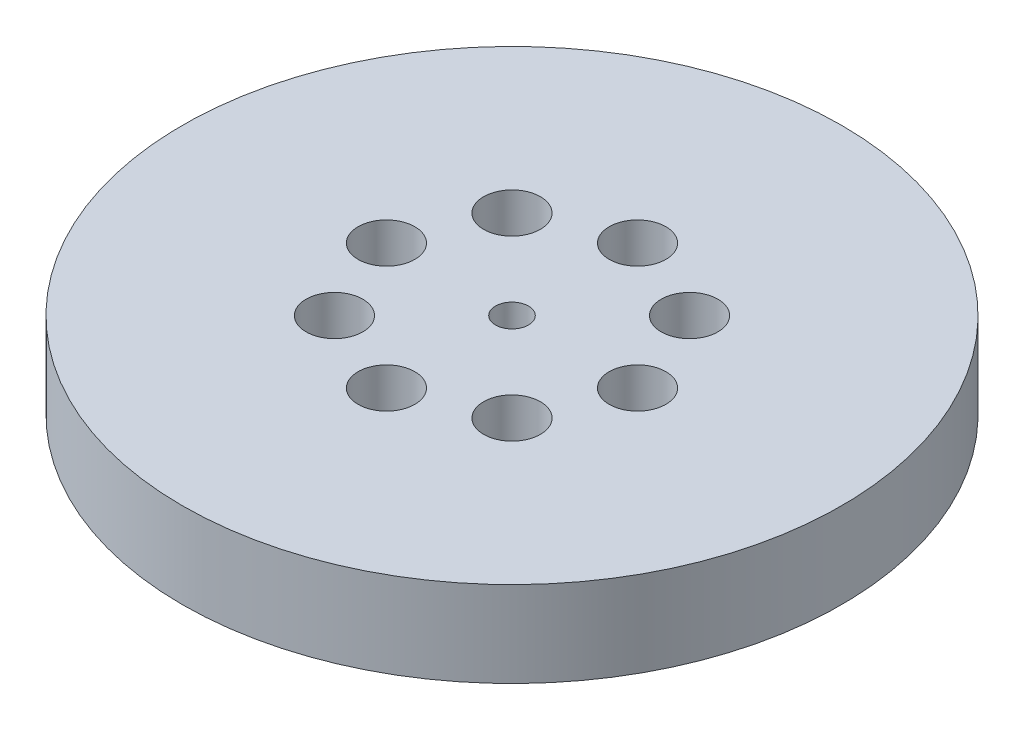
ISO-10303-21;
HEADER;
FILE_DESCRIPTION(('STEP AP214'),'2;1');
FILE_NAME('part.step','',(''),(''),'','','');
FILE_SCHEMA(('AUTOMOTIVE_DESIGN { 1 0 10303 214 1 1 1 1 }'));
ENDSEC;
DATA;
#1=APPLICATION_CONTEXT('core data for automotive mechanical design processes');
#2=APPLICATION_PROTOCOL_DEFINITION('international standard','automotive_design',2000,#1);
#3=PRODUCT_CONTEXT('',#1,'mechanical');
#4=PRODUCT('Part','Part','',(#3));
#5=PRODUCT_RELATED_PRODUCT_CATEGORY('part','',(#4));
#6=PRODUCT_DEFINITION_FORMATION('','',#4);
#7=PRODUCT_DEFINITION_CONTEXT('part definition',#1,'design');
#8=PRODUCT_DEFINITION('design','',#6,#7);
#9=PRODUCT_DEFINITION_SHAPE('','',#8);
#10=(LENGTH_UNIT() NAMED_UNIT(*) SI_UNIT(.MILLI.,.METRE.));
#11=(NAMED_UNIT(*) PLANE_ANGLE_UNIT() SI_UNIT($,.RADIAN.));
#12=(NAMED_UNIT(*) SI_UNIT($,.STERADIAN.) SOLID_ANGLE_UNIT());
#13=UNCERTAINTY_MEASURE_WITH_UNIT(LENGTH_MEASURE(1.E-05),#10,'distance_accuracy_value','');
#14=(GEOMETRIC_REPRESENTATION_CONTEXT(3) GLOBAL_UNCERTAINTY_ASSIGNED_CONTEXT((#13)) GLOBAL_UNIT_ASSIGNED_CONTEXT((#10,
#11,#12)) REPRESENTATION_CONTEXT('',''));
#15=CARTESIAN_POINT('',(0.,0.,0.));
#16=DIRECTION('',(0.,0.,1.));
#17=DIRECTION('',(1.,0.,0.));
#18=AXIS2_PLACEMENT_3D('',#15,#16,#17);
#19=CARTESIAN_POINT('',(0.,26.,0.));
#20=DIRECTION('',(0.,-1.,0.));
#21=DIRECTION('',(0.,0.,-1.));
#22=AXIS2_PLACEMENT_3D('',#19,#20,#21);
#23=CYLINDRICAL_SURFACE('',#22,100.);
#24=CARTESIAN_POINT('',(0.,26.,0.));
#25=DIRECTION('',(0.,1.,0.));
#26=DIRECTION('',(0.,0.,1.));
#27=AXIS2_PLACEMENT_3D('',#24,#25,#26);
#28=CIRCLE('',#27,100.);
#29=CARTESIAN_POINT('',(0.,26.,-100.));
#30=VERTEX_POINT('',#29);
#31=EDGE_CURVE('E10',#30,#30,#28,.T.);
#32=CARTESIAN_POINT('',(0.,0.,0.));
#33=DIRECTION('',(0.,1.,0.));
#34=DIRECTION('',(0.,0.,1.));
#35=AXIS2_PLACEMENT_3D('',#32,#33,#34);
#36=CIRCLE('',#35,100.);
#37=CARTESIAN_POINT('',(0.,0.,-100.));
#38=VERTEX_POINT('',#37);
#39=EDGE_CURVE('E37',#38,#38,#36,.T.);
#40=CARTESIAN_POINT('',(0.,26.,-100.));
#41=CARTESIAN_POINT('',(0.,25.7291666666667,-100.));
#42=CARTESIAN_POINT('',(0.,25.4583333333333,-100.));
#43=CARTESIAN_POINT('',(0.,24.9166666666667,-100.));
#44=CARTESIAN_POINT('',(0.,24.6458333333333,-100.));
#45=CARTESIAN_POINT('',(0.,24.1041666666667,-100.));
#46=CARTESIAN_POINT('',(0.,23.8333333333333,-100.));
#47=CARTESIAN_POINT('',(0.,23.2916666666667,-100.));
#48=CARTESIAN_POINT('',(0.,23.0208333333333,-100.));
#49=CARTESIAN_POINT('',(0.,22.4791666666667,-100.));
#50=CARTESIAN_POINT('',(0.,22.2083333333333,-100.));
#51=CARTESIAN_POINT('',(0.,21.6666666666667,-100.));
#52=CARTESIAN_POINT('',(0.,21.3958333333333,-100.));
#53=CARTESIAN_POINT('',(0.,20.8541666666667,-100.));
#54=CARTESIAN_POINT('',(0.,20.5833333333333,-100.));
#55=CARTESIAN_POINT('',(0.,20.0416666666667,-100.));
#56=CARTESIAN_POINT('',(0.,19.7708333333333,-100.));
#57=CARTESIAN_POINT('',(0.,19.2291666666667,-100.));
#58=CARTESIAN_POINT('',(0.,18.9583333333333,-100.));
#59=CARTESIAN_POINT('',(0.,18.4166666666667,-100.));
#60=CARTESIAN_POINT('',(0.,18.1458333333333,-100.));
#61=CARTESIAN_POINT('',(0.,17.6041666666667,-100.));
#62=CARTESIAN_POINT('',(0.,17.3333333333333,-100.));
#63=CARTESIAN_POINT('',(0.,16.7916666666667,-100.));
#64=CARTESIAN_POINT('',(0.,16.5208333333333,-100.));
#65=CARTESIAN_POINT('',(0.,15.9791666666667,-100.));
#66=CARTESIAN_POINT('',(0.,15.7083333333333,-100.));
#67=CARTESIAN_POINT('',(0.,15.1666666666667,-100.));
#68=CARTESIAN_POINT('',(0.,14.8958333333333,-100.));
#69=CARTESIAN_POINT('',(0.,14.3541666666667,-100.));
#70=CARTESIAN_POINT('',(0.,14.0833333333333,-100.));
#71=CARTESIAN_POINT('',(0.,13.5416666666667,-100.));
#72=CARTESIAN_POINT('',(0.,13.2708333333333,-100.));
#73=CARTESIAN_POINT('',(0.,12.7291666666667,-100.));
#74=CARTESIAN_POINT('',(0.,12.4583333333333,-100.));
#75=CARTESIAN_POINT('',(0.,11.9166666666667,-100.));
#76=CARTESIAN_POINT('',(0.,11.6458333333333,-100.));
#77=CARTESIAN_POINT('',(0.,11.1041666666667,-100.));
#78=CARTESIAN_POINT('',(0.,10.8333333333333,-100.));
#79=CARTESIAN_POINT('',(0.,10.2916666666667,-100.));
#80=CARTESIAN_POINT('',(0.,10.0208333333333,-100.));
#81=CARTESIAN_POINT('',(0.,9.47916666666667,-100.));
#82=CARTESIAN_POINT('',(0.,9.20833333333333,-100.));
#83=CARTESIAN_POINT('',(0.,8.66666666666667,-100.));
#84=CARTESIAN_POINT('',(0.,8.39583333333333,-100.));
#85=CARTESIAN_POINT('',(0.,7.85416666666667,-100.));
#86=CARTESIAN_POINT('',(0.,7.58333333333333,-100.));
#87=CARTESIAN_POINT('',(0.,7.04166666666667,-100.));
#88=CARTESIAN_POINT('',(0.,6.77083333333333,-100.));
#89=CARTESIAN_POINT('',(0.,6.22916666666667,-100.));
#90=CARTESIAN_POINT('',(0.,5.95833333333333,-100.));
#91=CARTESIAN_POINT('',(0.,5.41666666666667,-100.));
#92=CARTESIAN_POINT('',(0.,5.14583333333333,-100.));
#93=CARTESIAN_POINT('',(0.,4.60416666666667,-100.));
#94=CARTESIAN_POINT('',(0.,4.33333333333333,-100.));
#95=CARTESIAN_POINT('',(0.,3.79166666666667,-100.));
#96=CARTESIAN_POINT('',(0.,3.52083333333333,-100.));
#97=CARTESIAN_POINT('',(0.,2.97916666666667,-100.));
#98=CARTESIAN_POINT('',(0.,2.70833333333333,-100.));
#99=CARTESIAN_POINT('',(0.,2.16666666666667,-100.));
#100=CARTESIAN_POINT('',(0.,1.89583333333333,-100.));
#101=CARTESIAN_POINT('',(0.,1.35416666666667,-100.));
#102=CARTESIAN_POINT('',(0.,1.08333333333333,-100.));
#103=CARTESIAN_POINT('',(0.,0.541666666666667,-100.));
#104=CARTESIAN_POINT('',(0.,0.270833333333334,-100.));
#105=CARTESIAN_POINT('',(0.,0.,-100.));
#106=B_SPLINE_CURVE_WITH_KNOTS('',3,(#40,#41,#42,#43,#44,#45,#46,#47,#48,#49,#50,#51,#52,#53,
#54,#55,#56,#57,#58,#59,#60,#61,#62,#63,#64,#65,#66,#67,#68,#69,#70,#71,#72,#73,#74,#75,#76,#77,
#78,#79,#80,#81,#82,#83,#84,#85,#86,#87,#88,#89,#90,#91,#92,#93,#94,#95,#96,#97,#98,#99,#100,
#101,#102,#103,#104,#105),.UNSPECIFIED.,.F.,.F.,(4,2,2,2,2,2,2,2,2,2,2,2,2,2,2,2,2,2,2,2,2,2,2,
2,2,2,2,2,2,2,2,2,4),(0.,0.812500000000001,1.625,2.4375,3.25,4.0625,4.875,5.6875,6.5,7.3125,
8.125,8.9375,9.75,10.5625,11.375,12.1875,13.,13.8125,14.625,15.4375,16.25,17.0625,17.875,
18.6875,19.5,20.3125,21.125,21.9375,22.75,23.5625,24.375,25.1875,26.),.UNSPECIFIED.);
#107=EDGE_CURVE('BSEAM40',#30,#38,#106,.T.);
#108=ORIENTED_EDGE('',*,*,#31,.F.);
#109=ORIENTED_EDGE('',*,*,#39,.T.);
#110=ORIENTED_EDGE('',*,*,#107,.T.);
#111=ORIENTED_EDGE('',*,*,#107,.F.);
#112=EDGE_LOOP('',(#108,#110,#109,#111));
#113=FACE_BOUND('',#112,.T.);
#114=ADVANCED_FACE('F40',(#113),#23,.T.);
#115=CARTESIAN_POINT('',(0.,26.,0.));
#116=DIRECTION('',(0.,1.,0.));
#117=DIRECTION('',(0.,0.,1.));
#118=AXIS2_PLACEMENT_3D('',#115,#116,#117);
#119=PLANE('',#118);
#120=CARTESIAN_POINT('',(1.3300729688478E-13,26.,38.0948038888418));
#121=DIRECTION('',(0.,1.,0.));
#122=DIRECTION('',(1.,0.,0.));
#123=AXIS2_PLACEMENT_3D('',#120,#121,#122);
#124=CIRCLE('',#123,8.60573122294753);
#125=CARTESIAN_POINT('',(8.60573122294766,26.,38.0948038888417));
#126=VERTEX_POINT('',#125);
#127=EDGE_CURVE('E88',#126,#126,#124,.T.);
#128=ORIENTED_EDGE('',*,*,#127,.F.);
#129=EDGE_LOOP('',(#128));
#130=FACE_BOUND('',#129,.T.);
#131=CARTESIAN_POINT('',(26.9370941577718,26.,26.9370941577715));
#132=DIRECTION('',(0.,1.,0.));
#133=DIRECTION('',(0.707106781186544,0.,-0.707106781186551));
#134=AXIS2_PLACEMENT_3D('',#131,#132,#133);
#135=CIRCLE('',#134,8.60573122294753);
#136=CARTESIAN_POINT('',(33.0222650625868,26.,20.8519232529565));
#137=VERTEX_POINT('',#136);
#138=EDGE_CURVE('E79',#137,#137,#135,.T.);
#139=ORIENTED_EDGE('',*,*,#138,.F.);
#140=EDGE_LOOP('',(#139));
#141=FACE_BOUND('',#140,.T.);
#142=CARTESIAN_POINT('',(38.0948038888418,26.,0.));
#143=DIRECTION('',(0.,1.,0.));
#144=DIRECTION('',(0.,0.,-1.));
#145=AXIS2_PLACEMENT_3D('',#142,#143,#144);
#146=CIRCLE('',#145,8.60573122294753);
#147=CARTESIAN_POINT('',(38.0948038888418,26.,-8.60573122294753));
#148=VERTEX_POINT('',#147);
#149=EDGE_CURVE('E74',#148,#148,#146,.T.);
#150=ORIENTED_EDGE('',*,*,#149,.F.);
#151=EDGE_LOOP('',(#150));
#152=FACE_BOUND('',#151,.T.);
#153=CARTESIAN_POINT('',(26.9370941577714,26.,-26.9370941577719));
#154=DIRECTION('',(0.,1.,0.));
#155=DIRECTION('',(-0.707106781186554,0.,-0.707106781186541));
#156=AXIS2_PLACEMENT_3D('',#153,#154,#155);
#157=CIRCLE('',#156,8.60573122294753);
#158=CARTESIAN_POINT('',(20.8519232529564,26.,-33.0222650625868));
#159=VERTEX_POINT('',#158);
#160=EDGE_CURVE('E70',#159,#159,#157,.T.);
#161=ORIENTED_EDGE('',*,*,#160,.F.);
#162=EDGE_LOOP('',(#161));
#163=FACE_BOUND('',#162,.T.);
#164=CARTESIAN_POINT('',(-3.99021890654339E-13,26.,-38.0948038888418));
#165=DIRECTION('',(0.,1.,0.));
#166=DIRECTION('',(-1.,0.,0.));
#167=AXIS2_PLACEMENT_3D('',#164,#165,#166);
#168=CIRCLE('',#167,8.60573122294753);
#169=CARTESIAN_POINT('',(-8.60573122294793,26.,-38.0948038888417));
#170=VERTEX_POINT('',#169);
#171=EDGE_CURVE('E100',#170,#170,#168,.T.);
#172=ORIENTED_EDGE('',*,*,#171,.F.);
#173=EDGE_LOOP('',(#172));
#174=FACE_BOUND('',#173,.T.);
#175=CARTESIAN_POINT('',(-26.937094157772,26.,-26.9370941577713));
#176=DIRECTION('',(0.,1.,0.));
#177=DIRECTION('',(-0.707106781186539,0.,0.707106781186556));
#178=AXIS2_PLACEMENT_3D('',#175,#176,#177);
#179=CIRCLE('',#178,8.60573122294753);
#180=CARTESIAN_POINT('',(-33.0222650625869,26.,-20.8519232529563));
#181=VERTEX_POINT('',#180);
#182=EDGE_CURVE('E93',#181,#181,#179,.T.);
#183=ORIENTED_EDGE('',*,*,#182,.F.);
#184=EDGE_LOOP('',(#183));
#185=FACE_BOUND('',#184,.T.);
#186=CARTESIAN_POINT('',(-26.9370941577716,26.,26.9370941577717));
#187=DIRECTION('',(0.,1.,0.));
#188=DIRECTION('',(0.707106781186549,0.,0.707106781186546));
#189=AXIS2_PLACEMENT_3D('',#186,#187,#188);
#190=CIRCLE('',#189,8.60573122294753);
#191=CARTESIAN_POINT('',(-20.8519232529566,26.,33.0222650625867));
#192=VERTEX_POINT('',#191);
#193=EDGE_CURVE('E61',#192,#192,#190,.T.);
#194=ORIENTED_EDGE('',*,*,#193,.F.);
#195=EDGE_LOOP('',(#194));
#196=FACE_BOUND('',#195,.T.);
#197=CARTESIAN_POINT('',(-38.0948038888418,26.,0.));
#198=DIRECTION('',(0.,1.,0.));
#199=DIRECTION('',(0.,0.,1.));
#200=AXIS2_PLACEMENT_3D('',#197,#198,#199);
#201=CIRCLE('',#200,8.60573122294753);
#202=CARTESIAN_POINT('',(-38.0948038888418,26.,8.60573122294753));
#203=VERTEX_POINT('',#202);
#204=EDGE_CURVE('E54',#203,#203,#201,.T.);
#205=ORIENTED_EDGE('',*,*,#204,.F.);
#206=EDGE_LOOP('',(#205));
#207=FACE_BOUND('',#206,.T.);
#208=CARTESIAN_POINT('',(0.,26.,0.));
#209=DIRECTION('',(0.,1.,0.));
#210=DIRECTION('',(0.,0.,1.));
#211=AXIS2_PLACEMENT_3D('',#208,#209,#210);
#212=CIRCLE('',#211,5.);
#213=CARTESIAN_POINT('',(0.,26.,-5.));
#214=VERTEX_POINT('',#213);
#215=EDGE_CURVE('E50',#214,#214,#212,.T.);
#216=ORIENTED_EDGE('',*,*,#215,.F.);
#217=EDGE_LOOP('',(#216));
#218=FACE_BOUND('',#217,.T.);
#219=ORIENTED_EDGE('',*,*,#31,.T.);
#220=EDGE_LOOP('',(#219));
#221=FACE_BOUND('',#220,.T.);
#222=ADVANCED_FACE('F115',(#130,#141,#152,#163,#174,#185,#196,#207,#218,#221),#119,.T.);
#223=CARTESIAN_POINT('',(0.,0.,0.));
#224=DIRECTION('',(0.,1.,0.));
#225=DIRECTION('',(0.,0.,1.));
#226=AXIS2_PLACEMENT_3D('',#223,#224,#225);
#227=PLANE('',#226);
#228=CARTESIAN_POINT('',(0.,0.,0.));
#229=DIRECTION('',(0.,1.,0.));
#230=DIRECTION('',(0.,0.,1.));
#231=AXIS2_PLACEMENT_3D('',#228,#229,#230);
#232=CIRCLE('',#231,5.);
#233=CARTESIAN_POINT('',(0.,0.,-5.));
#234=VERTEX_POINT('',#233);
#235=EDGE_CURVE('E47',#234,#234,#232,.T.);
#236=ORIENTED_EDGE('',*,*,#235,.T.);
#237=EDGE_LOOP('',(#236));
#238=FACE_BOUND('',#237,.T.);
#239=ORIENTED_EDGE('',*,*,#39,.F.);
#240=EDGE_LOOP('',(#239));
#241=FACE_BOUND('',#240,.T.);
#242=ADVANCED_FACE('F113',(#238,#241),#227,.F.);
#243=CARTESIAN_POINT('',(0.,26.,0.));
#244=DIRECTION('',(0.,-1.,0.));
#245=DIRECTION('',(0.,0.,-1.));
#246=AXIS2_PLACEMENT_3D('',#243,#244,#245);
#247=CYLINDRICAL_SURFACE('',#246,5.);
#248=CARTESIAN_POINT('',(0.,26.,-5.));
#249=CARTESIAN_POINT('',(0.,25.7291666666667,-5.));
#250=CARTESIAN_POINT('',(0.,25.4583333333333,-5.));
#251=CARTESIAN_POINT('',(0.,24.9166666666667,-5.));
#252=CARTESIAN_POINT('',(0.,24.6458333333333,-5.));
#253=CARTESIAN_POINT('',(0.,24.1041666666667,-5.));
#254=CARTESIAN_POINT('',(0.,23.8333333333333,-5.));
#255=CARTESIAN_POINT('',(0.,23.2916666666667,-5.));
#256=CARTESIAN_POINT('',(0.,23.0208333333333,-5.));
#257=CARTESIAN_POINT('',(0.,22.4791666666667,-5.));
#258=CARTESIAN_POINT('',(0.,22.2083333333333,-5.));
#259=CARTESIAN_POINT('',(0.,21.6666666666667,-5.));
#260=CARTESIAN_POINT('',(0.,21.3958333333333,-5.));
#261=CARTESIAN_POINT('',(0.,20.8541666666667,-5.));
#262=CARTESIAN_POINT('',(0.,20.5833333333333,-5.));
#263=CARTESIAN_POINT('',(0.,20.0416666666667,-5.));
#264=CARTESIAN_POINT('',(0.,19.7708333333333,-5.));
#265=CARTESIAN_POINT('',(0.,19.2291666666667,-5.));
#266=CARTESIAN_POINT('',(0.,18.9583333333333,-5.));
#267=CARTESIAN_POINT('',(0.,18.4166666666667,-5.));
#268=CARTESIAN_POINT('',(0.,18.1458333333333,-5.));
#269=CARTESIAN_POINT('',(0.,17.6041666666667,-5.));
#270=CARTESIAN_POINT('',(0.,17.3333333333333,-5.));
#271=CARTESIAN_POINT('',(0.,16.7916666666667,-5.));
#272=CARTESIAN_POINT('',(0.,16.5208333333333,-5.));
#273=CARTESIAN_POINT('',(0.,15.9791666666667,-5.));
#274=CARTESIAN_POINT('',(0.,15.7083333333333,-5.));
#275=CARTESIAN_POINT('',(0.,15.1666666666667,-5.));
#276=CARTESIAN_POINT('',(0.,14.8958333333333,-5.));
#277=CARTESIAN_POINT('',(0.,14.3541666666667,-5.));
#278=CARTESIAN_POINT('',(0.,14.0833333333333,-5.));
#279=CARTESIAN_POINT('',(0.,13.5416666666667,-5.));
#280=CARTESIAN_POINT('',(0.,13.2708333333333,-5.));
#281=CARTESIAN_POINT('',(0.,12.7291666666667,-5.));
#282=CARTESIAN_POINT('',(0.,12.4583333333333,-5.));
#283=CARTESIAN_POINT('',(0.,11.9166666666667,-5.));
#284=CARTESIAN_POINT('',(0.,11.6458333333333,-5.));
#285=CARTESIAN_POINT('',(0.,11.1041666666667,-5.));
#286=CARTESIAN_POINT('',(0.,10.8333333333333,-5.));
#287=CARTESIAN_POINT('',(0.,10.2916666666667,-5.));
#288=CARTESIAN_POINT('',(0.,10.0208333333333,-5.));
#289=CARTESIAN_POINT('',(0.,9.47916666666667,-5.));
#290=CARTESIAN_POINT('',(0.,9.20833333333333,-5.));
#291=CARTESIAN_POINT('',(0.,8.66666666666667,-5.));
#292=CARTESIAN_POINT('',(0.,8.39583333333333,-5.));
#293=CARTESIAN_POINT('',(0.,7.85416666666667,-5.));
#294=CARTESIAN_POINT('',(0.,7.58333333333333,-5.));
#295=CARTESIAN_POINT('',(0.,7.04166666666667,-5.));
#296=CARTESIAN_POINT('',(0.,6.77083333333333,-5.));
#297=CARTESIAN_POINT('',(0.,6.22916666666667,-5.));
#298=CARTESIAN_POINT('',(0.,5.95833333333333,-5.));
#299=CARTESIAN_POINT('',(0.,5.41666666666667,-5.));
#300=CARTESIAN_POINT('',(0.,5.14583333333333,-5.));
#301=CARTESIAN_POINT('',(0.,4.60416666666667,-5.));
#302=CARTESIAN_POINT('',(0.,4.33333333333333,-5.));
#303=CARTESIAN_POINT('',(0.,3.79166666666667,-5.));
#304=CARTESIAN_POINT('',(0.,3.52083333333333,-5.));
#305=CARTESIAN_POINT('',(0.,2.97916666666667,-5.));
#306=CARTESIAN_POINT('',(0.,2.70833333333333,-5.));
#307=CARTESIAN_POINT('',(0.,2.16666666666667,-5.));
#308=CARTESIAN_POINT('',(0.,1.89583333333333,-5.));
#309=CARTESIAN_POINT('',(0.,1.35416666666667,-5.));
#310=CARTESIAN_POINT('',(0.,1.08333333333333,-5.));
#311=CARTESIAN_POINT('',(0.,0.541666666666667,-5.));
#312=CARTESIAN_POINT('',(0.,0.270833333333334,-5.));
#313=CARTESIAN_POINT('',(0.,0.,-5.));
#314=B_SPLINE_CURVE_WITH_KNOTS('',3,(#248,#249,#250,#251,#252,#253,#254,#255,#256,#257,#258,
#259,#260,#261,#262,#263,#264,#265,#266,#267,#268,#269,#270,#271,#272,#273,#274,#275,#276,#277,
#278,#279,#280,#281,#282,#283,#284,#285,#286,#287,#288,#289,#290,#291,#292,#293,#294,#295,#296,
#297,#298,#299,#300,#301,#302,#303,#304,#305,#306,#307,#308,#309,#310,#311,#312,#313),
.UNSPECIFIED.,.F.,.F.,(4,2,2,2,2,2,2,2,2,2,2,2,2,2,2,2,2,2,2,2,2,2,2,2,2,2,2,2,2,2,2,2,4),(0.,
0.812499999999997,1.625,2.4375,3.25,4.0625,4.875,5.6875,6.5,7.3125,8.125,8.93749999999999,
9.74999999999999,10.5625,11.375,12.1875,13.,13.8125,14.625,15.4375,16.25,17.0625,17.875,18.6875,
19.5,20.3125,21.125,21.9375,22.75,23.5625,24.375,25.1875,26.),.UNSPECIFIED.);
#315=EDGE_CURVE('BSEAM127',#214,#234,#314,.T.);
#316=ORIENTED_EDGE('',*,*,#215,.T.);
#317=ORIENTED_EDGE('',*,*,#235,.F.);
#318=ORIENTED_EDGE('',*,*,#315,.T.);
#319=ORIENTED_EDGE('',*,*,#315,.F.);
#320=EDGE_LOOP('',(#316,#318,#317,#319));
#321=FACE_BOUND('',#320,.T.);
#322=ADVANCED_FACE('F127',(#321),#247,.F.);
#323=CARTESIAN_POINT('',(-38.0948038888418,5.05024986186004,0.));
#324=DIRECTION('',(0.,1.,0.));
#325=DIRECTION('',(0.,0.,1.));
#326=AXIS2_PLACEMENT_3D('',#323,#324,#325);
#327=CYLINDRICAL_SURFACE('',#326,8.60573122294753);
#328=CARTESIAN_POINT('',(-38.0948038888418,5.05024986186004,0.));
#329=DIRECTION('',(0.,1.,0.));
#330=DIRECTION('',(0.,0.,1.));
#331=AXIS2_PLACEMENT_3D('',#328,#329,#330);
#332=CIRCLE('',#331,8.60573122294753);
#333=CARTESIAN_POINT('',(-38.0948038888418,5.05024986186004,8.60573122294753));
#334=VERTEX_POINT('',#333);
#335=EDGE_CURVE('E55',#334,#334,#332,.T.);
#336=ORIENTED_EDGE('',*,*,#335,.F.);
#337=EDGE_LOOP('',(#336));
#338=FACE_BOUND('',#337,.T.);
#339=ORIENTED_EDGE('',*,*,#204,.T.);
#340=EDGE_LOOP('',(#339));
#341=FACE_BOUND('',#340,.T.);
#342=ADVANCED_FACE('F129',(#338,#341),#327,.F.);
#343=CARTESIAN_POINT('',(-38.0948038888418,5.05024986186004,0.));
#344=DIRECTION('',(0.,1.,0.));
#345=DIRECTION('',(0.,0.,1.));
#346=AXIS2_PLACEMENT_3D('',#343,#344,#345);
#347=PLANE('',#346);
#348=ORIENTED_EDGE('',*,*,#335,.T.);
#349=EDGE_LOOP('',(#348));
#350=FACE_BOUND('',#349,.T.);
#351=ADVANCED_FACE('F157',(#350),#347,.T.);
#352=CARTESIAN_POINT('',(-26.9370941577716,5.05024986186004,26.9370941577717));
#353=DIRECTION('',(0.,1.,0.));
#354=DIRECTION('',(0.,0.,1.));
#355=AXIS2_PLACEMENT_3D('',#352,#353,#354);
#356=CYLINDRICAL_SURFACE('',#355,8.60573122294753);
#357=CARTESIAN_POINT('',(-26.9370941577716,5.05024986186004,26.9370941577717));
#358=DIRECTION('',(0.,1.,0.));
#359=DIRECTION('',(0.707106781186549,0.,0.707106781186546));
#360=AXIS2_PLACEMENT_3D('',#357,#358,#359);
#361=CIRCLE('',#360,8.60573122294753);
#362=CARTESIAN_POINT('',(-20.8519232529566,5.05024986186004,33.0222650625867));
#363=VERTEX_POINT('',#362);
#364=EDGE_CURVE('E59',#363,#363,#361,.T.);
#365=ORIENTED_EDGE('',*,*,#364,.F.);
#366=EDGE_LOOP('',(#365));
#367=FACE_BOUND('',#366,.T.);
#368=ORIENTED_EDGE('',*,*,#193,.T.);
#369=EDGE_LOOP('',(#368));
#370=FACE_BOUND('',#369,.T.);
#371=ADVANCED_FACE('F170',(#367,#370),#356,.F.);
#372=CARTESIAN_POINT('',(-26.9370941577716,5.05024986186004,26.9370941577717));
#373=DIRECTION('',(0.,1.,0.));
#374=DIRECTION('',(0.707106781186549,0.,0.707106781186546));
#375=AXIS2_PLACEMENT_3D('',#372,#373,#374);
#376=PLANE('',#375);
#377=ORIENTED_EDGE('',*,*,#364,.T.);
#378=EDGE_LOOP('',(#377));
#379=FACE_BOUND('',#378,.T.);
#380=ADVANCED_FACE('F182',(#379),#376,.T.);
#381=CARTESIAN_POINT('',(-26.937094157772,5.05024986186004,-26.9370941577713));
#382=DIRECTION('',(0.,1.,0.));
#383=DIRECTION('',(0.,0.,1.));
#384=AXIS2_PLACEMENT_3D('',#381,#382,#383);
#385=CYLINDRICAL_SURFACE('',#384,8.60573122294753);
#386=CARTESIAN_POINT('',(-26.937094157772,5.05024986186004,-26.9370941577713));
#387=DIRECTION('',(0.,1.,0.));
#388=DIRECTION('',(-0.707106781186539,0.,0.707106781186556));
#389=AXIS2_PLACEMENT_3D('',#386,#387,#388);
#390=CIRCLE('',#389,8.60573122294753);
#391=CARTESIAN_POINT('',(-33.0222650625869,5.05024986186004,-20.8519232529563));
#392=VERTEX_POINT('',#391);
#393=EDGE_CURVE('E94',#392,#392,#390,.T.);
#394=ORIENTED_EDGE('',*,*,#393,.F.);
#395=EDGE_LOOP('',(#394));
#396=FACE_BOUND('',#395,.T.);
#397=ORIENTED_EDGE('',*,*,#182,.T.);
#398=EDGE_LOOP('',(#397));
#399=FACE_BOUND('',#398,.T.);
#400=ADVANCED_FACE('F189',(#396,#399),#385,.F.);
#401=CARTESIAN_POINT('',(-26.937094157772,5.05024986186004,-26.9370941577713));
#402=DIRECTION('',(0.,1.,0.));
#403=DIRECTION('',(-0.707106781186539,0.,0.707106781186556));
#404=AXIS2_PLACEMENT_3D('',#401,#402,#403);
#405=PLANE('',#404);
#406=ORIENTED_EDGE('',*,*,#393,.T.);
#407=EDGE_LOOP('',(#406));
#408=FACE_BOUND('',#407,.T.);
#409=ADVANCED_FACE('F107',(#408),#405,.T.);
#410=CARTESIAN_POINT('',(-3.99021890654339E-13,5.05024986186004,-38.0948038888418));
#411=DIRECTION('',(0.,1.,0.));
#412=DIRECTION('',(0.,0.,1.));
#413=AXIS2_PLACEMENT_3D('',#410,#411,#412);
#414=CYLINDRICAL_SURFACE('',#413,8.60573122294753);
#415=CARTESIAN_POINT('',(-3.99021890654339E-13,5.05024986186004,-38.0948038888418));
#416=DIRECTION('',(0.,1.,0.));
#417=DIRECTION('',(-1.,0.,0.));
#418=AXIS2_PLACEMENT_3D('',#415,#416,#417);
#419=CIRCLE('',#418,8.60573122294753);
#420=CARTESIAN_POINT('',(-8.60573122294793,5.05024986186004,-38.0948038888417));
#421=VERTEX_POINT('',#420);
#422=EDGE_CURVE('E72',#421,#421,#419,.T.);
#423=ORIENTED_EDGE('',*,*,#422,.F.);
#424=EDGE_LOOP('',(#423));
#425=FACE_BOUND('',#424,.T.);
#426=ORIENTED_EDGE('',*,*,#171,.T.);
#427=EDGE_LOOP('',(#426));
#428=FACE_BOUND('',#427,.T.);
#429=ADVANCED_FACE('F104',(#425,#428),#414,.F.);
#430=CARTESIAN_POINT('',(-3.99021890654339E-13,5.05024986186004,-38.0948038888418));
#431=DIRECTION('',(0.,1.,0.));
#432=DIRECTION('',(-1.,0.,0.));
#433=AXIS2_PLACEMENT_3D('',#430,#431,#432);
#434=PLANE('',#433);
#435=ORIENTED_EDGE('',*,*,#422,.T.);
#436=EDGE_LOOP('',(#435));
#437=FACE_BOUND('',#436,.T.);
#438=ADVANCED_FACE('F103',(#437),#434,.T.);
#439=CARTESIAN_POINT('',(26.9370941577714,5.05024986186004,-26.9370941577719));
#440=DIRECTION('',(0.,1.,0.));
#441=DIRECTION('',(0.,0.,1.));
#442=AXIS2_PLACEMENT_3D('',#439,#440,#441);
#443=CYLINDRICAL_SURFACE('',#442,8.60573122294753);
#444=CARTESIAN_POINT('',(26.9370941577714,5.05024986186004,-26.9370941577719));
#445=DIRECTION('',(0.,1.,0.));
#446=DIRECTION('',(-0.707106781186554,0.,-0.707106781186541));
#447=AXIS2_PLACEMENT_3D('',#444,#445,#446);
#448=CIRCLE('',#447,8.60573122294753);
#449=CARTESIAN_POINT('',(20.8519232529564,5.05024986186004,-33.0222650625868));
#450=VERTEX_POINT('',#449);
#451=EDGE_CURVE('E69',#450,#450,#448,.T.);
#452=ORIENTED_EDGE('',*,*,#451,.F.);
#453=EDGE_LOOP('',(#452));
#454=FACE_BOUND('',#453,.T.);
#455=ORIENTED_EDGE('',*,*,#160,.T.);
#456=EDGE_LOOP('',(#455));
#457=FACE_BOUND('',#456,.T.);
#458=ADVANCED_FACE('F219',(#454,#457),#443,.F.);
#459=CARTESIAN_POINT('',(26.9370941577714,5.05024986186004,-26.9370941577719));
#460=DIRECTION('',(0.,1.,0.));
#461=DIRECTION('',(-0.707106781186554,0.,-0.707106781186541));
#462=AXIS2_PLACEMENT_3D('',#459,#460,#461);
#463=PLANE('',#462);
#464=ORIENTED_EDGE('',*,*,#451,.T.);
#465=EDGE_LOOP('',(#464));
#466=FACE_BOUND('',#465,.T.);
#467=ADVANCED_FACE('F227',(#466),#463,.T.);
#468=CARTESIAN_POINT('',(38.0948038888418,5.05024986186004,0.));
#469=DIRECTION('',(0.,1.,0.));
#470=DIRECTION('',(0.,0.,1.));
#471=AXIS2_PLACEMENT_3D('',#468,#469,#470);
#472=CYLINDRICAL_SURFACE('',#471,8.60573122294753);
#473=CARTESIAN_POINT('',(38.0948038888418,5.05024986186004,0.));
#474=DIRECTION('',(0.,1.,0.));
#475=DIRECTION('',(0.,0.,-1.));
#476=AXIS2_PLACEMENT_3D('',#473,#474,#475);
#477=CIRCLE('',#476,8.60573122294753);
#478=CARTESIAN_POINT('',(38.0948038888418,5.05024986186004,-8.60573122294753));
#479=VERTEX_POINT('',#478);
#480=EDGE_CURVE('E80',#479,#479,#477,.T.);
#481=ORIENTED_EDGE('',*,*,#480,.F.);
#482=EDGE_LOOP('',(#481));
#483=FACE_BOUND('',#482,.T.);
#484=ORIENTED_EDGE('',*,*,#149,.T.);
#485=EDGE_LOOP('',(#484));
#486=FACE_BOUND('',#485,.T.);
#487=ADVANCED_FACE('F240',(#483,#486),#472,.F.);
#488=CARTESIAN_POINT('',(38.0948038888418,5.05024986186004,0.));
#489=DIRECTION('',(0.,1.,0.));
#490=DIRECTION('',(0.,0.,-1.));
#491=AXIS2_PLACEMENT_3D('',#488,#489,#490);
#492=PLANE('',#491);
#493=ORIENTED_EDGE('',*,*,#480,.T.);
#494=EDGE_LOOP('',(#493));
#495=FACE_BOUND('',#494,.T.);
#496=ADVANCED_FACE('F246',(#495),#492,.T.);
#497=CARTESIAN_POINT('',(26.9370941577718,5.05024986186004,26.9370941577715));
#498=DIRECTION('',(0.,1.,0.));
#499=DIRECTION('',(0.,0.,1.));
#500=AXIS2_PLACEMENT_3D('',#497,#498,#499);
#501=CYLINDRICAL_SURFACE('',#500,8.60573122294753);
#502=CARTESIAN_POINT('',(26.9370941577718,5.05024986186004,26.9370941577715));
#503=DIRECTION('',(0.,1.,0.));
#504=DIRECTION('',(0.707106781186544,0.,-0.707106781186551));
#505=AXIS2_PLACEMENT_3D('',#502,#503,#504);
#506=CIRCLE('',#505,8.60573122294753);
#507=CARTESIAN_POINT('',(33.0222650625868,5.05024986186004,20.8519232529565));
#508=VERTEX_POINT('',#507);
#509=EDGE_CURVE('E82',#508,#508,#506,.T.);
#510=ORIENTED_EDGE('',*,*,#509,.F.);
#511=EDGE_LOOP('',(#510));
#512=FACE_BOUND('',#511,.T.);
#513=ORIENTED_EDGE('',*,*,#138,.T.);
#514=EDGE_LOOP('',(#513));
#515=FACE_BOUND('',#514,.T.);
#516=ADVANCED_FACE('F254',(#512,#515),#501,.F.);
#517=CARTESIAN_POINT('',(26.9370941577718,5.05024986186004,26.9370941577715));
#518=DIRECTION('',(0.,1.,0.));
#519=DIRECTION('',(0.707106781186544,0.,-0.707106781186551));
#520=AXIS2_PLACEMENT_3D('',#517,#518,#519);
#521=PLANE('',#520);
#522=ORIENTED_EDGE('',*,*,#509,.T.);
#523=EDGE_LOOP('',(#522));
#524=FACE_BOUND('',#523,.T.);
#525=ADVANCED_FACE('F262',(#524),#521,.T.);
#526=CARTESIAN_POINT('',(1.3300729688478E-13,5.05024986186004,38.0948038888418));
#527=DIRECTION('',(0.,1.,0.));
#528=DIRECTION('',(0.,0.,1.));
#529=AXIS2_PLACEMENT_3D('',#526,#527,#528);
#530=CYLINDRICAL_SURFACE('',#529,8.60573122294753);
#531=CARTESIAN_POINT('',(1.3300729688478E-13,5.05024986186004,38.0948038888418));
#532=DIRECTION('',(0.,1.,0.));
#533=DIRECTION('',(1.,0.,0.));
#534=AXIS2_PLACEMENT_3D('',#531,#532,#533);
#535=CIRCLE('',#534,8.60573122294753);
#536=CARTESIAN_POINT('',(8.60573122294766,5.05024986186004,38.0948038888417));
#537=VERTEX_POINT('',#536);
#538=EDGE_CURVE('E63',#537,#537,#535,.T.);
#539=ORIENTED_EDGE('',*,*,#538,.F.);
#540=EDGE_LOOP('',(#539));
#541=FACE_BOUND('',#540,.T.);
#542=ORIENTED_EDGE('',*,*,#127,.T.);
#543=EDGE_LOOP('',(#542));
#544=FACE_BOUND('',#543,.T.);
#545=ADVANCED_FACE('F272',(#541,#544),#530,.F.);
#546=CARTESIAN_POINT('',(1.3300729688478E-13,5.05024986186004,38.0948038888418));
#547=DIRECTION('',(0.,1.,0.));
#548=DIRECTION('',(1.,0.,0.));
#549=AXIS2_PLACEMENT_3D('',#546,#547,#548);
#550=PLANE('',#549);
#551=ORIENTED_EDGE('',*,*,#538,.T.);
#552=EDGE_LOOP('',(#551));
#553=FACE_BOUND('',#552,.T.);
#554=ADVANCED_FACE('F285',(#553),#550,.T.);
#555=CLOSED_SHELL('',(#114,#222,#242,#322,#342,#351,#371,#380,#400,#409,#429,#438,#458,#467,
#487,#496,#516,#525,#545,#554));
#556=MANIFOLD_SOLID_BREP('B2',#555);
#557=ADVANCED_BREP_SHAPE_REPRESENTATION('',(#18,#556),#14);
#558=SHAPE_DEFINITION_REPRESENTATION(#9,#557);
ENDSEC;
END-ISO-10303-21;
